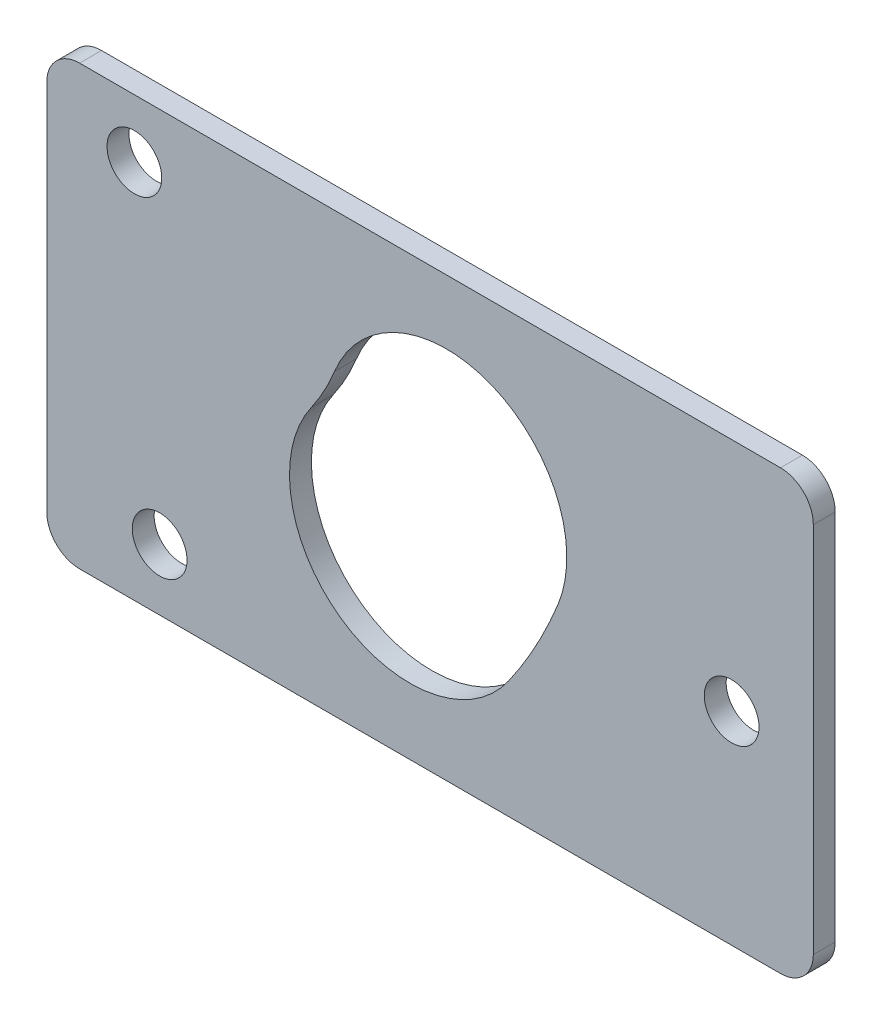
ISO-10303-21;
HEADER;
FILE_DESCRIPTION(('STEP AP214'),'2;1');
FILE_NAME('part.step','',(''),(''),'','','');
FILE_SCHEMA(('AUTOMOTIVE_DESIGN { 1 0 10303 214 1 1 1 1 }'));
ENDSEC;
DATA;
#1=APPLICATION_CONTEXT('core data for automotive mechanical design processes');
#2=APPLICATION_PROTOCOL_DEFINITION('international standard','automotive_design',2000,#1);
#3=PRODUCT_CONTEXT('',#1,'mechanical');
#4=PRODUCT('Part','Part','',(#3));
#5=PRODUCT_RELATED_PRODUCT_CATEGORY('part','',(#4));
#6=PRODUCT_DEFINITION_FORMATION('','',#4);
#7=PRODUCT_DEFINITION_CONTEXT('part definition',#1,'design');
#8=PRODUCT_DEFINITION('design','',#6,#7);
#9=PRODUCT_DEFINITION_SHAPE('','',#8);
#10=(LENGTH_UNIT() NAMED_UNIT(*) SI_UNIT(.MILLI.,.METRE.));
#11=(NAMED_UNIT(*) PLANE_ANGLE_UNIT() SI_UNIT($,.RADIAN.));
#12=(NAMED_UNIT(*) SI_UNIT($,.STERADIAN.) SOLID_ANGLE_UNIT());
#13=UNCERTAINTY_MEASURE_WITH_UNIT(LENGTH_MEASURE(1.E-05),#10,'distance_accuracy_value','');
#14=(GEOMETRIC_REPRESENTATION_CONTEXT(3) GLOBAL_UNCERTAINTY_ASSIGNED_CONTEXT((#13)) GLOBAL_UNIT_ASSIGNED_CONTEXT((#10,
#11,#12)) REPRESENTATION_CONTEXT('',''));
#15=CARTESIAN_POINT('',(0.,0.,0.));
#16=DIRECTION('',(0.,0.,1.));
#17=DIRECTION('',(1.,0.,0.));
#18=AXIS2_PLACEMENT_3D('',#15,#16,#17);
#19=CARTESIAN_POINT('',(-32.,17.,2.));
#20=DIRECTION('',(0.,0.,-1.));
#21=DIRECTION('',(-1.,0.,0.));
#22=AXIS2_PLACEMENT_3D('',#19,#20,#21);
#23=CYLINDRICAL_SURFACE('',#22,3.);
#24=CARTESIAN_POINT('',(-32.,17.,0.));
#25=DIRECTION('',(0.,0.,1.));
#26=DIRECTION('',(1.,0.,0.));
#27=AXIS2_PLACEMENT_3D('',#24,#25,#26);
#28=CIRCLE('',#27,3.);
#29=CARTESIAN_POINT('',(-35.,17.,0.));
#30=VERTEX_POINT('',#29);
#31=CARTESIAN_POINT('',(-32.,20.,0.));
#32=VERTEX_POINT('',#31);
#33=EDGE_CURVE('E180',#30,#32,#28,.F.);
#34=ORIENTED_EDGE('',*,*,#33,.F.);
#35=DIRECTION('',(0.,0.,-1.));
#36=VECTOR('',#35,1.);
#37=CARTESIAN_POINT('',(-35.,17.,2.));
#38=LINE('',#37,#36);
#39=CARTESIAN_POINT('',(-35.,17.,2.));
#40=VERTEX_POINT('',#39);
#41=EDGE_CURVE('E11',#40,#30,#38,.T.);
#42=ORIENTED_EDGE('',*,*,#41,.F.);
#43=CARTESIAN_POINT('',(-32.,17.,2.));
#44=DIRECTION('',(0.,0.,1.));
#45=DIRECTION('',(1.,0.,0.));
#46=AXIS2_PLACEMENT_3D('',#43,#44,#45);
#47=CIRCLE('',#46,3.);
#48=CARTESIAN_POINT('',(-32.,20.,2.));
#49=VERTEX_POINT('',#48);
#50=EDGE_CURVE('E248',#40,#49,#47,.F.);
#51=ORIENTED_EDGE('',*,*,#50,.T.);
#52=DIRECTION('',(0.,0.,-1.));
#53=VECTOR('',#52,1.);
#54=CARTESIAN_POINT('',(-32.,20.,2.));
#55=LINE('',#54,#53);
#56=EDGE_CURVE('E54',#49,#32,#55,.T.);
#57=ORIENTED_EDGE('',*,*,#56,.T.);
#58=EDGE_LOOP('',(#34,#42,#51,#57));
#59=FACE_BOUND('',#58,.T.);
#60=ADVANCED_FACE('F35',(#59),#23,.T.);
#61=CARTESIAN_POINT('',(-35.,0.,2.));
#62=DIRECTION('',(-1.,0.,0.));
#63=DIRECTION('',(0.,0.,1.));
#64=AXIS2_PLACEMENT_3D('',#61,#62,#63);
#65=PLANE('',#64);
#66=DIRECTION('',(0.,1.,0.));
#67=VECTOR('',#66,1.);
#68=CARTESIAN_POINT('',(-35.,0.,0.));
#69=LINE('',#68,#67);
#70=CARTESIAN_POINT('',(-35.,-17.,0.));
#71=VERTEX_POINT('',#70);
#72=EDGE_CURVE('E182',#71,#30,#69,.T.);
#73=ORIENTED_EDGE('',*,*,#72,.F.);
#74=DIRECTION('',(0.,0.,-1.));
#75=VECTOR('',#74,1.);
#76=CARTESIAN_POINT('',(-35.,-17.,2.));
#77=LINE('',#76,#75);
#78=CARTESIAN_POINT('',(-35.,-17.,2.));
#79=VERTEX_POINT('',#78);
#80=EDGE_CURVE('E45',#79,#71,#77,.T.);
#81=ORIENTED_EDGE('',*,*,#80,.F.);
#82=DIRECTION('',(0.,1.,0.));
#83=VECTOR('',#82,1.);
#84=CARTESIAN_POINT('',(-35.,0.,2.));
#85=LINE('',#84,#83);
#86=EDGE_CURVE('E250',#79,#40,#85,.T.);
#87=ORIENTED_EDGE('',*,*,#86,.T.);
#88=ORIENTED_EDGE('',*,*,#41,.T.);
#89=EDGE_LOOP('',(#73,#81,#87,#88));
#90=FACE_BOUND('',#89,.T.);
#91=ADVANCED_FACE('F281',(#90),#65,.T.);
#92=CARTESIAN_POINT('',(-32.,-17.,2.));
#93=DIRECTION('',(0.,0.,-1.));
#94=DIRECTION('',(-1.,0.,0.));
#95=AXIS2_PLACEMENT_3D('',#92,#93,#94);
#96=CYLINDRICAL_SURFACE('',#95,3.);
#97=CARTESIAN_POINT('',(-32.,-17.,0.));
#98=DIRECTION('',(0.,0.,1.));
#99=DIRECTION('',(1.,0.,0.));
#100=AXIS2_PLACEMENT_3D('',#97,#98,#99);
#101=CIRCLE('',#100,3.);
#102=CARTESIAN_POINT('',(-32.,-20.,0.));
#103=VERTEX_POINT('',#102);
#104=EDGE_CURVE('E185',#103,#71,#101,.F.);
#105=ORIENTED_EDGE('',*,*,#104,.F.);
#106=DIRECTION('',(0.,0.,-1.));
#107=VECTOR('',#106,1.);
#108=CARTESIAN_POINT('',(-32.,-20.,2.));
#109=LINE('',#108,#107);
#110=CARTESIAN_POINT('',(-32.,-20.,2.));
#111=VERTEX_POINT('',#110);
#112=EDGE_CURVE('E207',#111,#103,#109,.T.);
#113=ORIENTED_EDGE('',*,*,#112,.F.);
#114=CARTESIAN_POINT('',(-32.,-17.,2.));
#115=DIRECTION('',(0.,0.,1.));
#116=DIRECTION('',(1.,0.,0.));
#117=AXIS2_PLACEMENT_3D('',#114,#115,#116);
#118=CIRCLE('',#117,3.);
#119=EDGE_CURVE('E253',#111,#79,#118,.F.);
#120=ORIENTED_EDGE('',*,*,#119,.T.);
#121=ORIENTED_EDGE('',*,*,#80,.T.);
#122=EDGE_LOOP('',(#105,#113,#120,#121));
#123=FACE_BOUND('',#122,.T.);
#124=ADVANCED_FACE('F286',(#123),#96,.T.);
#125=CARTESIAN_POINT('',(0.,-20.,2.));
#126=DIRECTION('',(0.,1.,0.));
#127=DIRECTION('',(0.,0.,1.));
#128=AXIS2_PLACEMENT_3D('',#125,#126,#127);
#129=PLANE('',#128);
#130=DIRECTION('',(1.,0.,0.));
#131=VECTOR('',#130,1.);
#132=CARTESIAN_POINT('',(0.,-20.,0.));
#133=LINE('',#132,#131);
#134=CARTESIAN_POINT('',(32.,-20.,0.));
#135=VERTEX_POINT('',#134);
#136=EDGE_CURVE('E188',#103,#135,#133,.T.);
#137=ORIENTED_EDGE('',*,*,#136,.T.);
#138=DIRECTION('',(0.,0.,-1.));
#139=VECTOR('',#138,1.);
#140=CARTESIAN_POINT('',(32.,-20.,2.));
#141=LINE('',#140,#139);
#142=CARTESIAN_POINT('',(32.,-20.,2.));
#143=VERTEX_POINT('',#142);
#144=EDGE_CURVE('E204',#143,#135,#141,.T.);
#145=ORIENTED_EDGE('',*,*,#144,.F.);
#146=DIRECTION('',(1.,0.,0.));
#147=VECTOR('',#146,1.);
#148=CARTESIAN_POINT('',(0.,-20.,2.));
#149=LINE('',#148,#147);
#150=EDGE_CURVE('E256',#111,#143,#149,.T.);
#151=ORIENTED_EDGE('',*,*,#150,.F.);
#152=ORIENTED_EDGE('',*,*,#112,.T.);
#153=EDGE_LOOP('',(#137,#145,#151,#152));
#154=FACE_BOUND('',#153,.T.);
#155=ADVANCED_FACE('F262',(#154),#129,.F.);
#156=CARTESIAN_POINT('',(32.,-17.,2.));
#157=DIRECTION('',(0.,0.,-1.));
#158=DIRECTION('',(-1.,0.,0.));
#159=AXIS2_PLACEMENT_3D('',#156,#157,#158);
#160=CYLINDRICAL_SURFACE('',#159,3.);
#161=CARTESIAN_POINT('',(32.,-17.,0.));
#162=DIRECTION('',(0.,0.,1.));
#163=DIRECTION('',(1.,0.,0.));
#164=AXIS2_PLACEMENT_3D('',#161,#162,#163);
#165=CIRCLE('',#164,3.);
#166=CARTESIAN_POINT('',(35.,-17.,0.));
#167=VERTEX_POINT('',#166);
#168=EDGE_CURVE('E191',#135,#167,#165,.T.);
#169=ORIENTED_EDGE('',*,*,#168,.T.);
#170=DIRECTION('',(0.,0.,-1.));
#171=VECTOR('',#170,1.);
#172=CARTESIAN_POINT('',(35.,-17.,2.));
#173=LINE('',#172,#171);
#174=CARTESIAN_POINT('',(35.,-17.,2.));
#175=VERTEX_POINT('',#174);
#176=EDGE_CURVE('E150',#175,#167,#173,.T.);
#177=ORIENTED_EDGE('',*,*,#176,.F.);
#178=CARTESIAN_POINT('',(32.,-17.,2.));
#179=DIRECTION('',(0.,0.,1.));
#180=DIRECTION('',(1.,0.,0.));
#181=AXIS2_PLACEMENT_3D('',#178,#179,#180);
#182=CIRCLE('',#181,3.);
#183=EDGE_CURVE('E139',#143,#175,#182,.T.);
#184=ORIENTED_EDGE('',*,*,#183,.F.);
#185=ORIENTED_EDGE('',*,*,#144,.T.);
#186=EDGE_LOOP('',(#169,#177,#184,#185));
#187=FACE_BOUND('',#186,.T.);
#188=ADVANCED_FACE('F265',(#187),#160,.T.);
#189=CARTESIAN_POINT('',(35.,0.,2.));
#190=DIRECTION('',(-1.,0.,0.));
#191=DIRECTION('',(0.,0.,1.));
#192=AXIS2_PLACEMENT_3D('',#189,#190,#191);
#193=PLANE('',#192);
#194=DIRECTION('',(0.,1.,0.));
#195=VECTOR('',#194,1.);
#196=CARTESIAN_POINT('',(35.,0.,0.));
#197=LINE('',#196,#195);
#198=CARTESIAN_POINT('',(35.,17.,0.));
#199=VERTEX_POINT('',#198);
#200=EDGE_CURVE('E147',#167,#199,#197,.T.);
#201=ORIENTED_EDGE('',*,*,#200,.T.);
#202=DIRECTION('',(0.,0.,-1.));
#203=VECTOR('',#202,1.);
#204=CARTESIAN_POINT('',(35.,17.,2.));
#205=LINE('',#204,#203);
#206=CARTESIAN_POINT('',(35.,17.,2.));
#207=VERTEX_POINT('',#206);
#208=EDGE_CURVE('E145',#207,#199,#205,.T.);
#209=ORIENTED_EDGE('',*,*,#208,.F.);
#210=DIRECTION('',(0.,1.,0.));
#211=VECTOR('',#210,1.);
#212=CARTESIAN_POINT('',(35.,0.,2.));
#213=LINE('',#212,#211);
#214=EDGE_CURVE('E131',#175,#207,#213,.T.);
#215=ORIENTED_EDGE('',*,*,#214,.F.);
#216=ORIENTED_EDGE('',*,*,#176,.T.);
#217=EDGE_LOOP('',(#201,#209,#215,#216));
#218=FACE_BOUND('',#217,.T.);
#219=ADVANCED_FACE('F146',(#218),#193,.F.);
#220=CARTESIAN_POINT('',(32.,17.,2.));
#221=DIRECTION('',(0.,0.,-1.));
#222=DIRECTION('',(-1.,0.,0.));
#223=AXIS2_PLACEMENT_3D('',#220,#221,#222);
#224=CYLINDRICAL_SURFACE('',#223,3.);
#225=CARTESIAN_POINT('',(32.,17.,0.));
#226=DIRECTION('',(0.,0.,1.));
#227=DIRECTION('',(1.,0.,0.));
#228=AXIS2_PLACEMENT_3D('',#225,#226,#227);
#229=CIRCLE('',#228,3.);
#230=CARTESIAN_POINT('',(32.,20.,0.));
#231=VERTEX_POINT('',#230);
#232=EDGE_CURVE('E195',#231,#199,#229,.F.);
#233=ORIENTED_EDGE('',*,*,#232,.F.);
#234=DIRECTION('',(0.,0.,-1.));
#235=VECTOR('',#234,1.);
#236=CARTESIAN_POINT('',(32.,20.,2.));
#237=LINE('',#236,#235);
#238=CARTESIAN_POINT('',(32.,20.,2.));
#239=VERTEX_POINT('',#238);
#240=EDGE_CURVE('E91',#239,#231,#237,.T.);
#241=ORIENTED_EDGE('',*,*,#240,.F.);
#242=CARTESIAN_POINT('',(32.,17.,2.));
#243=DIRECTION('',(0.,0.,1.));
#244=DIRECTION('',(1.,0.,0.));
#245=AXIS2_PLACEMENT_3D('',#242,#243,#244);
#246=CIRCLE('',#245,3.);
#247=EDGE_CURVE('E137',#239,#207,#246,.F.);
#248=ORIENTED_EDGE('',*,*,#247,.T.);
#249=ORIENTED_EDGE('',*,*,#208,.T.);
#250=EDGE_LOOP('',(#233,#241,#248,#249));
#251=FACE_BOUND('',#250,.T.);
#252=ADVANCED_FACE('F152',(#251),#224,.T.);
#253=CARTESIAN_POINT('',(-27.,14.6666666666667,2.));
#254=DIRECTION('',(0.,0.,-1.));
#255=DIRECTION('',(-1.,0.,0.));
#256=AXIS2_PLACEMENT_3D('',#253,#254,#255);
#257=CYLINDRICAL_SURFACE('',#256,41.72639111759);
#258=CARTESIAN_POINT('',(-27.,14.6666666666667,0.));
#259=DIRECTION('',(0.,0.,1.));
#260=DIRECTION('',(1.,0.,0.));
#261=AXIS2_PLACEMENT_3D('',#258,#259,#260);
#262=CIRCLE('',#261,41.72639111759);
#263=CARTESIAN_POINT('',(7.17556018686413,-9.27331665855973,0.));
#264=VERTEX_POINT('',#263);
#265=CARTESIAN_POINT('',(11.6849672833306,-0.971908140064599,0.));
#266=VERTEX_POINT('',#265);
#267=EDGE_CURVE('E159',#264,#266,#262,.T.);
#268=ORIENTED_EDGE('',*,*,#267,.F.);
#269=DIRECTION('',(0.,0.,-1.));
#270=VECTOR('',#269,1.);
#271=CARTESIAN_POINT('',(7.17556018686413,-9.27331665855973,2.));
#272=LINE('',#271,#270);
#273=CARTESIAN_POINT('',(7.17556018686413,-9.27331665855973,2.));
#274=VERTEX_POINT('',#273);
#275=EDGE_CURVE('E39',#274,#264,#272,.T.);
#276=ORIENTED_EDGE('',*,*,#275,.F.);
#277=CARTESIAN_POINT('',(-27.,14.6666666666667,2.));
#278=DIRECTION('',(0.,0.,1.));
#279=DIRECTION('',(1.,0.,0.));
#280=AXIS2_PLACEMENT_3D('',#277,#278,#279);
#281=CIRCLE('',#280,41.72639111759);
#282=CARTESIAN_POINT('',(11.6849672833306,-0.971908140064599,2.));
#283=VERTEX_POINT('',#282);
#284=EDGE_CURVE('E200',#274,#283,#281,.T.);
#285=ORIENTED_EDGE('',*,*,#284,.T.);
#286=DIRECTION('',(0.,0.,-1.));
#287=VECTOR('',#286,1.);
#288=CARTESIAN_POINT('',(11.6849672833306,-0.971908140064599,2.));
#289=LINE('',#288,#287);
#290=EDGE_CURVE('E155',#283,#266,#289,.T.);
#291=ORIENTED_EDGE('',*,*,#290,.T.);
#292=EDGE_LOOP('',(#268,#276,#285,#291));
#293=FACE_BOUND('',#292,.T.);
#294=ADVANCED_FACE('F37',(#293),#257,.F.);
#295=CARTESIAN_POINT('',(-1.83387369866137,-2.96220732165667,2.));
#296=DIRECTION('',(0.,0.,-1.));
#297=DIRECTION('',(-1.,0.,0.));
#298=AXIS2_PLACEMENT_3D('',#295,#296,#297);
#299=CYLINDRICAL_SURFACE('',#298,11.);
#300=CARTESIAN_POINT('',(-1.83387369866137,-2.96220732165667,0.));
#301=DIRECTION('',(0.,0.,1.));
#302=DIRECTION('',(1.,0.,0.));
#303=AXIS2_PLACEMENT_3D('',#300,#301,#302);
#304=CIRCLE('',#303,11.);
#305=CARTESIAN_POINT('',(-10.8433075841869,3.34890201524636,0.));
#306=VERTEX_POINT('',#305);
#307=EDGE_CURVE('E162',#306,#264,#304,.T.);
#308=ORIENTED_EDGE('',*,*,#307,.F.);
#309=DIRECTION('',(0.,0.,-1.));
#310=VECTOR('',#309,1.);
#311=CARTESIAN_POINT('',(-10.8433075841869,3.34890201524636,2.));
#312=LINE('',#311,#310);
#313=CARTESIAN_POINT('',(-10.8433075841869,3.34890201524636,2.));
#314=VERTEX_POINT('',#313);
#315=EDGE_CURVE('E212',#314,#306,#312,.T.);
#316=ORIENTED_EDGE('',*,*,#315,.F.);
#317=CARTESIAN_POINT('',(-1.83387369866137,-2.96220732165667,2.));
#318=DIRECTION('',(0.,0.,1.));
#319=DIRECTION('',(1.,0.,0.));
#320=AXIS2_PLACEMENT_3D('',#317,#318,#319);
#321=CIRCLE('',#320,11.);
#322=EDGE_CURVE('E221',#314,#274,#321,.T.);
#323=ORIENTED_EDGE('',*,*,#322,.T.);
#324=ORIENTED_EDGE('',*,*,#275,.T.);
#325=EDGE_LOOP('',(#308,#316,#323,#324));
#326=FACE_BOUND('',#325,.T.);
#327=ADVANCED_FACE('F219',(#326),#299,.F.);
#328=CARTESIAN_POINT('',(-27.,14.6666666666667,2.));
#329=DIRECTION('',(0.,0.,-1.));
#330=DIRECTION('',(-1.,0.,0.));
#331=AXIS2_PLACEMENT_3D('',#328,#329,#330);
#332=CYLINDRICAL_SURFACE('',#331,19.72639111759);
#333=CARTESIAN_POINT('',(-27.,14.6666666666667,0.));
#334=DIRECTION('',(0.,0.,1.));
#335=DIRECTION('',(1.,0.,0.));
#336=AXIS2_PLACEMENT_3D('',#333,#334,#335);
#337=CIRCLE('',#336,19.72639111759);
#338=CARTESIAN_POINT('',(-8.71145947293639,7.27344058368478,0.));
#339=VERTEX_POINT('',#338);
#340=EDGE_CURVE('E165',#306,#339,#337,.T.);
#341=ORIENTED_EDGE('',*,*,#340,.T.);
#342=DIRECTION('',(0.,0.,-1.));
#343=VECTOR('',#342,1.);
#344=CARTESIAN_POINT('',(-8.71145947293639,7.27344058368478,2.));
#345=LINE('',#344,#343);
#346=CARTESIAN_POINT('',(-8.71145947293639,7.27344058368478,2.));
#347=VERTEX_POINT('',#346);
#348=EDGE_CURVE('E211',#347,#339,#345,.T.);
#349=ORIENTED_EDGE('',*,*,#348,.F.);
#350=CARTESIAN_POINT('',(-27.,14.6666666666667,2.));
#351=DIRECTION('',(0.,0.,1.));
#352=DIRECTION('',(1.,0.,0.));
#353=AXIS2_PLACEMENT_3D('',#350,#351,#352);
#354=CIRCLE('',#353,19.72639111759);
#355=EDGE_CURVE('E229',#314,#347,#354,.T.);
#356=ORIENTED_EDGE('',*,*,#355,.F.);
#357=ORIENTED_EDGE('',*,*,#315,.T.);
#358=EDGE_LOOP('',(#341,#349,#356,#357));
#359=FACE_BOUND('',#358,.T.);
#360=ADVANCED_FACE('F227',(#359),#332,.T.);
#361=CARTESIAN_POINT('',(-27.,14.6666666666667,2.));
#362=DIRECTION('',(0.,0.,-1.));
#363=DIRECTION('',(-1.,0.,0.));
#364=AXIS2_PLACEMENT_3D('',#361,#362,#363);
#365=CYLINDRICAL_SURFACE('',#364,2.5);
#366=CARTESIAN_POINT('',(-27.,14.6666666666667,2.));
#367=DIRECTION('',(0.,0.,1.));
#368=DIRECTION('',(1.,0.,0.));
#369=AXIS2_PLACEMENT_3D('',#366,#367,#368);
#370=CIRCLE('',#369,2.5);
#371=CARTESIAN_POINT('',(-24.5,14.6666666666667,2.));
#372=VERTEX_POINT('',#371);
#373=EDGE_CURVE('E245',#372,#372,#370,.T.);
#374=ORIENTED_EDGE('',*,*,#373,.T.);
#375=EDGE_LOOP('',(#374));
#376=FACE_BOUND('',#375,.T.);
#377=CARTESIAN_POINT('',(-27.,14.6666666666667,0.));
#378=DIRECTION('',(0.,0.,1.));
#379=DIRECTION('',(1.,0.,0.));
#380=AXIS2_PLACEMENT_3D('',#377,#378,#379);
#381=CIRCLE('',#380,2.5);
#382=CARTESIAN_POINT('',(-24.5,14.6666666666667,0.));
#383=VERTEX_POINT('',#382);
#384=EDGE_CURVE('E177',#383,#383,#381,.T.);
#385=ORIENTED_EDGE('',*,*,#384,.F.);
#386=EDGE_LOOP('',(#385));
#387=FACE_BOUND('',#386,.T.);
#388=ADVANCED_FACE('F291',(#376,#387),#365,.F.);
#389=CARTESIAN_POINT('',(27.540515542733,-1.48897005929847,2.));
#390=DIRECTION('',(0.,0.,-1.));
#391=DIRECTION('',(-1.,0.,0.));
#392=AXIS2_PLACEMENT_3D('',#389,#390,#391);
#393=CYLINDRICAL_SURFACE('',#392,2.5);
#394=CARTESIAN_POINT('',(27.540515542733,-1.48897005929847,2.));
#395=DIRECTION('',(0.,0.,1.));
#396=DIRECTION('',(1.,0.,0.));
#397=AXIS2_PLACEMENT_3D('',#394,#395,#396);
#398=CIRCLE('',#397,2.5);
#399=CARTESIAN_POINT('',(30.040515542733,-1.48897005929847,2.));
#400=VERTEX_POINT('',#399);
#401=EDGE_CURVE('E238',#400,#400,#398,.T.);
#402=ORIENTED_EDGE('',*,*,#401,.T.);
#403=EDGE_LOOP('',(#402));
#404=FACE_BOUND('',#403,.T.);
#405=CARTESIAN_POINT('',(27.540515542733,-1.48897005929847,0.));
#406=DIRECTION('',(0.,0.,1.));
#407=DIRECTION('',(1.,0.,0.));
#408=AXIS2_PLACEMENT_3D('',#405,#406,#407);
#409=CIRCLE('',#408,2.5);
#410=CARTESIAN_POINT('',(30.040515542733,-1.48897005929847,0.));
#411=VERTEX_POINT('',#410);
#412=EDGE_CURVE('E174',#411,#411,#409,.T.);
#413=ORIENTED_EDGE('',*,*,#412,.F.);
#414=EDGE_LOOP('',(#413));
#415=FACE_BOUND('',#414,.T.);
#416=ADVANCED_FACE('F294',(#404,#415),#393,.F.);
#417=CARTESIAN_POINT('',(-24.6937526512765,-14.408678002158,2.));
#418=DIRECTION('',(0.,0.,-1.));
#419=DIRECTION('',(-1.,0.,0.));
#420=AXIS2_PLACEMENT_3D('',#417,#418,#419);
#421=CYLINDRICAL_SURFACE('',#420,2.5);
#422=CARTESIAN_POINT('',(-24.6937526512765,-14.408678002158,2.));
#423=DIRECTION('',(0.,0.,1.));
#424=DIRECTION('',(1.,0.,0.));
#425=AXIS2_PLACEMENT_3D('',#422,#423,#424);
#426=CIRCLE('',#425,2.5);
#427=CARTESIAN_POINT('',(-22.1937526512765,-14.408678002158,2.));
#428=VERTEX_POINT('',#427);
#429=EDGE_CURVE('E235',#428,#428,#426,.T.);
#430=ORIENTED_EDGE('',*,*,#429,.T.);
#431=EDGE_LOOP('',(#430));
#432=FACE_BOUND('',#431,.T.);
#433=CARTESIAN_POINT('',(-24.6937526512765,-14.408678002158,0.));
#434=DIRECTION('',(0.,0.,1.));
#435=DIRECTION('',(1.,0.,0.));
#436=AXIS2_PLACEMENT_3D('',#433,#434,#435);
#437=CIRCLE('',#436,2.5);
#438=CARTESIAN_POINT('',(-22.1937526512765,-14.408678002158,0.));
#439=VERTEX_POINT('',#438);
#440=EDGE_CURVE('E171',#439,#439,#437,.T.);
#441=ORIENTED_EDGE('',*,*,#440,.F.);
#442=EDGE_LOOP('',(#441));
#443=FACE_BOUND('',#442,.T.);
#444=ADVANCED_FACE('F276',(#432,#443),#421,.F.);
#445=CARTESIAN_POINT('',(1.48675390519712,3.1507662218101,2.));
#446=DIRECTION('',(0.,0.,-1.));
#447=DIRECTION('',(-1.,0.,0.));
#448=AXIS2_PLACEMENT_3D('',#445,#446,#447);
#449=CYLINDRICAL_SURFACE('',#448,11.);
#450=CARTESIAN_POINT('',(1.48675390519712,3.1507662218101,0.));
#451=DIRECTION('',(0.,0.,1.));
#452=DIRECTION('',(1.,0.,0.));
#453=AXIS2_PLACEMENT_3D('',#450,#451,#452);
#454=CIRCLE('',#453,11.);
#455=EDGE_CURVE('E168',#266,#339,#454,.T.);
#456=ORIENTED_EDGE('',*,*,#455,.F.);
#457=ORIENTED_EDGE('',*,*,#290,.F.);
#458=CARTESIAN_POINT('',(1.48675390519712,3.1507662218101,2.));
#459=DIRECTION('',(0.,0.,1.));
#460=DIRECTION('',(1.,0.,0.));
#461=AXIS2_PLACEMENT_3D('',#458,#459,#460);
#462=CIRCLE('',#461,11.);
#463=EDGE_CURVE('E232',#283,#347,#462,.T.);
#464=ORIENTED_EDGE('',*,*,#463,.T.);
#465=ORIENTED_EDGE('',*,*,#348,.T.);
#466=EDGE_LOOP('',(#456,#457,#464,#465));
#467=FACE_BOUND('',#466,.T.);
#468=ADVANCED_FACE('F233',(#467),#449,.F.);
#469=CARTESIAN_POINT('',(0.,20.,2.));
#470=DIRECTION('',(0.,1.,0.));
#471=DIRECTION('',(0.,0.,1.));
#472=AXIS2_PLACEMENT_3D('',#469,#470,#471);
#473=PLANE('',#472);
#474=DIRECTION('',(1.,0.,0.));
#475=VECTOR('',#474,1.);
#476=CARTESIAN_POINT('',(0.,20.,0.));
#477=LINE('',#476,#475);
#478=EDGE_CURVE('E197',#32,#231,#477,.T.);
#479=ORIENTED_EDGE('',*,*,#478,.F.);
#480=ORIENTED_EDGE('',*,*,#56,.F.);
#481=DIRECTION('',(1.,0.,0.));
#482=VECTOR('',#481,1.);
#483=CARTESIAN_POINT('',(0.,20.,2.));
#484=LINE('',#483,#482);
#485=EDGE_CURVE('E153',#49,#239,#484,.T.);
#486=ORIENTED_EDGE('',*,*,#485,.T.);
#487=ORIENTED_EDGE('',*,*,#240,.T.);
#488=EDGE_LOOP('',(#479,#480,#486,#487));
#489=FACE_BOUND('',#488,.T.);
#490=ADVANCED_FACE('F268',(#489),#473,.T.);
#491=CARTESIAN_POINT('',(0.,0.,2.));
#492=DIRECTION('',(0.,0.,1.));
#493=DIRECTION('',(1.,0.,0.));
#494=AXIS2_PLACEMENT_3D('',#491,#492,#493);
#495=PLANE('',#494);
#496=ORIENTED_EDGE('',*,*,#284,.F.);
#497=ORIENTED_EDGE('',*,*,#322,.F.);
#498=ORIENTED_EDGE('',*,*,#355,.T.);
#499=ORIENTED_EDGE('',*,*,#463,.F.);
#500=EDGE_LOOP('',(#496,#497,#498,#499));
#501=FACE_BOUND('',#500,.T.);
#502=ORIENTED_EDGE('',*,*,#429,.F.);
#503=EDGE_LOOP('',(#502));
#504=FACE_BOUND('',#503,.T.);
#505=ORIENTED_EDGE('',*,*,#401,.F.);
#506=EDGE_LOOP('',(#505));
#507=FACE_BOUND('',#506,.T.);
#508=ORIENTED_EDGE('',*,*,#373,.F.);
#509=EDGE_LOOP('',(#508));
#510=FACE_BOUND('',#509,.T.);
#511=ORIENTED_EDGE('',*,*,#50,.F.);
#512=ORIENTED_EDGE('',*,*,#86,.F.);
#513=ORIENTED_EDGE('',*,*,#119,.F.);
#514=ORIENTED_EDGE('',*,*,#150,.T.);
#515=ORIENTED_EDGE('',*,*,#183,.T.);
#516=ORIENTED_EDGE('',*,*,#214,.T.);
#517=ORIENTED_EDGE('',*,*,#247,.F.);
#518=ORIENTED_EDGE('',*,*,#485,.F.);
#519=EDGE_LOOP('',(#511,#512,#513,#514,#515,#516,#517,#518));
#520=FACE_BOUND('',#519,.T.);
#521=ADVANCED_FACE('F134',(#501,#504,#507,#510,#520),#495,.T.);
#522=CARTESIAN_POINT('',(0.,0.,0.));
#523=DIRECTION('',(0.,0.,1.));
#524=DIRECTION('',(1.,0.,0.));
#525=AXIS2_PLACEMENT_3D('',#522,#523,#524);
#526=PLANE('',#525);
#527=ORIENTED_EDGE('',*,*,#267,.T.);
#528=ORIENTED_EDGE('',*,*,#455,.T.);
#529=ORIENTED_EDGE('',*,*,#340,.F.);
#530=ORIENTED_EDGE('',*,*,#307,.T.);
#531=EDGE_LOOP('',(#527,#528,#529,#530));
#532=FACE_BOUND('',#531,.T.);
#533=ORIENTED_EDGE('',*,*,#440,.T.);
#534=EDGE_LOOP('',(#533));
#535=FACE_BOUND('',#534,.T.);
#536=ORIENTED_EDGE('',*,*,#412,.T.);
#537=EDGE_LOOP('',(#536));
#538=FACE_BOUND('',#537,.T.);
#539=ORIENTED_EDGE('',*,*,#384,.T.);
#540=EDGE_LOOP('',(#539));
#541=FACE_BOUND('',#540,.T.);
#542=ORIENTED_EDGE('',*,*,#33,.T.);
#543=ORIENTED_EDGE('',*,*,#478,.T.);
#544=ORIENTED_EDGE('',*,*,#232,.T.);
#545=ORIENTED_EDGE('',*,*,#200,.F.);
#546=ORIENTED_EDGE('',*,*,#168,.F.);
#547=ORIENTED_EDGE('',*,*,#136,.F.);
#548=ORIENTED_EDGE('',*,*,#104,.T.);
#549=ORIENTED_EDGE('',*,*,#72,.T.);
#550=EDGE_LOOP('',(#542,#543,#544,#545,#546,#547,#548,#549));
#551=FACE_BOUND('',#550,.T.);
#552=ADVANCED_FACE('F224',(#532,#535,#538,#541,#551),#526,.F.);
#553=CLOSED_SHELL('',(#60,#91,#124,#155,#188,#219,#252,#294,#327,#360,#388,#416,#444,#468,#490,
#521,#552));
#554=MANIFOLD_SOLID_BREP('B2',#553);
#555=ADVANCED_BREP_SHAPE_REPRESENTATION('',(#18,#554),#14);
#556=SHAPE_DEFINITION_REPRESENTATION(#9,#555);
ENDSEC;
END-ISO-10303-21;
